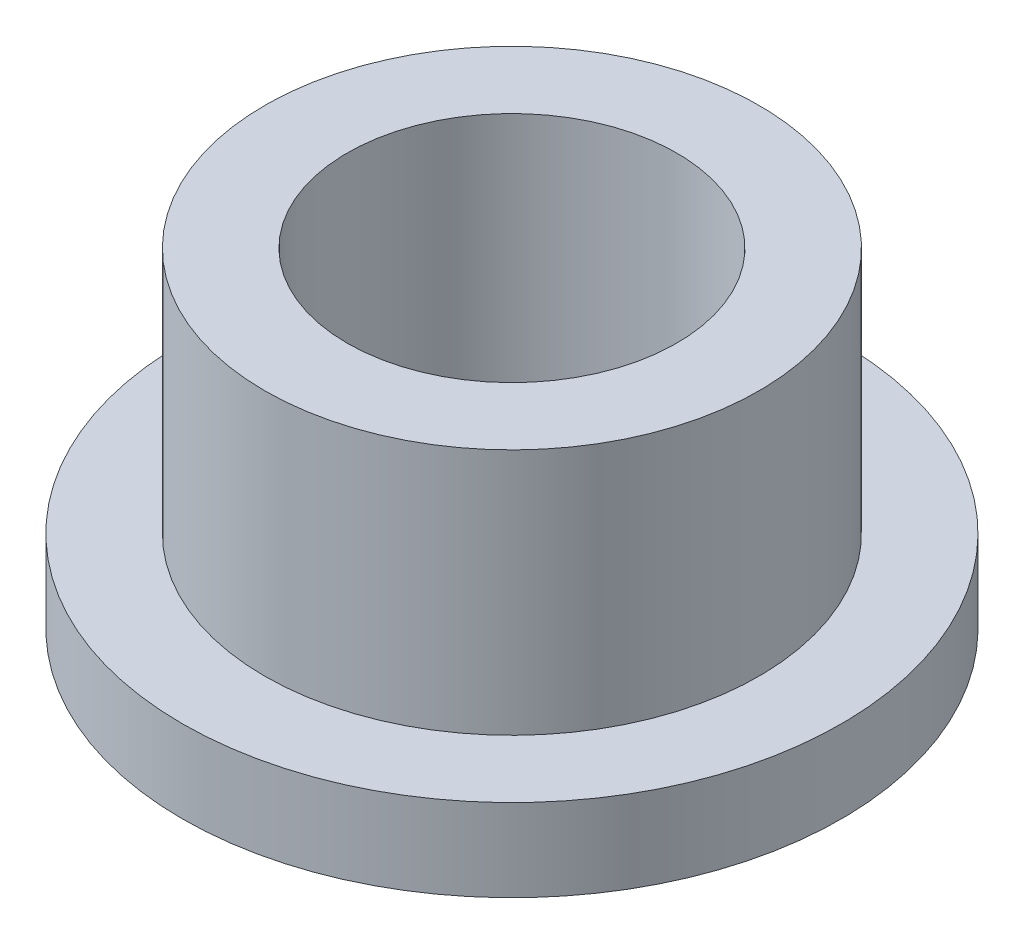
ISO-10303-21;
HEADER;
FILE_DESCRIPTION(('STEP AP214'),'2;1');
FILE_NAME('part.step','',(''),(''),'','','');
FILE_SCHEMA(('AUTOMOTIVE_DESIGN { 1 0 10303 214 1 1 1 1 }'));
ENDSEC;
DATA;
#1=APPLICATION_CONTEXT('core data for automotive mechanical design processes');
#2=APPLICATION_PROTOCOL_DEFINITION('international standard','automotive_design',2000,#1);
#3=PRODUCT_CONTEXT('',#1,'mechanical');
#4=PRODUCT('Part','Part','',(#3));
#5=PRODUCT_RELATED_PRODUCT_CATEGORY('part','',(#4));
#6=PRODUCT_DEFINITION_FORMATION('','',#4);
#7=PRODUCT_DEFINITION_CONTEXT('part definition',#1,'design');
#8=PRODUCT_DEFINITION('design','',#6,#7);
#9=PRODUCT_DEFINITION_SHAPE('','',#8);
#10=(LENGTH_UNIT() NAMED_UNIT(*) SI_UNIT(.MILLI.,.METRE.));
#11=(NAMED_UNIT(*) PLANE_ANGLE_UNIT() SI_UNIT($,.RADIAN.));
#12=(NAMED_UNIT(*) SI_UNIT($,.STERADIAN.) SOLID_ANGLE_UNIT());
#13=UNCERTAINTY_MEASURE_WITH_UNIT(LENGTH_MEASURE(1.E-05),#10,'distance_accuracy_value','');
#14=(GEOMETRIC_REPRESENTATION_CONTEXT(3) GLOBAL_UNCERTAINTY_ASSIGNED_CONTEXT((#13)) GLOBAL_UNIT_ASSIGNED_CONTEXT((#10,
#11,#12)) REPRESENTATION_CONTEXT('',''));
#15=CARTESIAN_POINT('',(0.,0.,0.));
#16=DIRECTION('',(0.,0.,1.));
#17=DIRECTION('',(1.,0.,0.));
#18=AXIS2_PLACEMENT_3D('',#15,#16,#17);
#19=CARTESIAN_POINT('',(0.,9.525,0.));
#20=DIRECTION('',(0.,-1.,0.));
#21=DIRECTION('',(0.,0.,-1.));
#22=AXIS2_PLACEMENT_3D('',#19,#20,#21);
#23=CYLINDRICAL_SURFACE('',#22,4.7625);
#24=CARTESIAN_POINT('',(0.,1.5875,0.));
#25=DIRECTION('',(0.,1.,0.));
#26=DIRECTION('',(0.,0.,1.));
#27=AXIS2_PLACEMENT_3D('',#24,#25,#26);
#28=CIRCLE('',#27,4.7625);
#29=CARTESIAN_POINT('',(0.,1.5875,4.7625));
#30=VERTEX_POINT('',#29);
#31=EDGE_CURVE('E61',#30,#30,#28,.T.);
#32=ORIENTED_EDGE('',*,*,#31,.T.);
#33=EDGE_LOOP('',(#32));
#34=FACE_BOUND('',#33,.T.);
#35=CARTESIAN_POINT('',(0.,6.35,0.));
#36=DIRECTION('',(0.,1.,0.));
#37=DIRECTION('',(0.,0.,1.));
#38=AXIS2_PLACEMENT_3D('',#35,#36,#37);
#39=CIRCLE('',#38,4.7625);
#40=CARTESIAN_POINT('',(0.,6.35,4.7625));
#41=VERTEX_POINT('',#40);
#42=EDGE_CURVE('E66',#41,#41,#39,.T.);
#43=ORIENTED_EDGE('',*,*,#42,.F.);
#44=EDGE_LOOP('',(#43));
#45=FACE_BOUND('',#44,.T.);
#46=ADVANCED_FACE('F41',(#34,#45),#23,.T.);
#47=CARTESIAN_POINT('',(0.,9.525,0.));
#48=DIRECTION('',(0.,-1.,0.));
#49=DIRECTION('',(0.,0.,-1.));
#50=AXIS2_PLACEMENT_3D('',#47,#48,#49);
#51=CYLINDRICAL_SURFACE('',#50,3.175);
#52=CARTESIAN_POINT('',(0.,0.,0.));
#53=DIRECTION('',(0.,1.,0.));
#54=DIRECTION('',(0.,0.,1.));
#55=AXIS2_PLACEMENT_3D('',#52,#53,#54);
#56=CIRCLE('',#55,3.175);
#57=CARTESIAN_POINT('',(0.,0.,3.175));
#58=VERTEX_POINT('',#57);
#59=EDGE_CURVE('E12',#58,#58,#56,.T.);
#60=ORIENTED_EDGE('',*,*,#59,.F.);
#61=EDGE_LOOP('',(#60));
#62=FACE_BOUND('',#61,.T.);
#63=CARTESIAN_POINT('',(0.,6.35,0.));
#64=DIRECTION('',(0.,1.,0.));
#65=DIRECTION('',(0.,0.,1.));
#66=AXIS2_PLACEMENT_3D('',#63,#64,#65);
#67=CIRCLE('',#66,3.175);
#68=CARTESIAN_POINT('',(0.,6.35,3.175));
#69=VERTEX_POINT('',#68);
#70=EDGE_CURVE('E44',#69,#69,#67,.T.);
#71=ORIENTED_EDGE('',*,*,#70,.T.);
#72=EDGE_LOOP('',(#71));
#73=FACE_BOUND('',#72,.T.);
#74=ADVANCED_FACE('F73',(#62,#73),#51,.F.);
#75=CARTESIAN_POINT('',(0.,0.,0.));
#76=DIRECTION('',(0.,1.,0.));
#77=DIRECTION('',(0.,0.,1.));
#78=AXIS2_PLACEMENT_3D('',#75,#76,#77);
#79=PLANE('',#78);
#80=ORIENTED_EDGE('',*,*,#59,.T.);
#81=EDGE_LOOP('',(#80));
#82=FACE_BOUND('',#81,.T.);
#83=CARTESIAN_POINT('',(0.,0.,0.));
#84=DIRECTION('',(0.,1.,0.));
#85=DIRECTION('',(0.,0.,1.));
#86=AXIS2_PLACEMENT_3D('',#83,#84,#85);
#87=CIRCLE('',#86,6.35);
#88=CARTESIAN_POINT('',(0.,0.,6.35));
#89=VERTEX_POINT('',#88);
#90=EDGE_CURVE('E56',#89,#89,#87,.T.);
#91=ORIENTED_EDGE('',*,*,#90,.F.);
#92=EDGE_LOOP('',(#91));
#93=FACE_BOUND('',#92,.T.);
#94=ADVANCED_FACE('F91',(#82,#93),#79,.F.);
#95=CARTESIAN_POINT('',(0.,1.5875,0.));
#96=DIRECTION('',(0.,1.,0.));
#97=DIRECTION('',(0.,0.,1.));
#98=AXIS2_PLACEMENT_3D('',#95,#96,#97);
#99=PLANE('',#98);
#100=CARTESIAN_POINT('',(0.,1.5875,0.));
#101=DIRECTION('',(0.,1.,0.));
#102=DIRECTION('',(0.,0.,1.));
#103=AXIS2_PLACEMENT_3D('',#100,#101,#102);
#104=CIRCLE('',#103,6.35);
#105=CARTESIAN_POINT('',(0.,1.5875,6.35));
#106=VERTEX_POINT('',#105);
#107=EDGE_CURVE('E49',#106,#106,#104,.T.);
#108=ORIENTED_EDGE('',*,*,#107,.T.);
#109=EDGE_LOOP('',(#108));
#110=FACE_BOUND('',#109,.T.);
#111=ORIENTED_EDGE('',*,*,#31,.F.);
#112=EDGE_LOOP('',(#111));
#113=FACE_BOUND('',#112,.T.);
#114=ADVANCED_FACE('F82',(#110,#113),#99,.T.);
#115=CARTESIAN_POINT('',(0.,1.5875,0.));
#116=DIRECTION('',(0.,-1.,0.));
#117=DIRECTION('',(0.,0.,-1.));
#118=AXIS2_PLACEMENT_3D('',#115,#116,#117);
#119=CYLINDRICAL_SURFACE('',#118,6.35);
#120=ORIENTED_EDGE('',*,*,#107,.F.);
#121=EDGE_LOOP('',(#120));
#122=FACE_BOUND('',#121,.T.);
#123=ORIENTED_EDGE('',*,*,#90,.T.);
#124=EDGE_LOOP('',(#123));
#125=FACE_BOUND('',#124,.T.);
#126=ADVANCED_FACE('F77',(#122,#125),#119,.T.);
#127=CARTESIAN_POINT('',(0.,6.35,0.));
#128=DIRECTION('',(0.,1.,0.));
#129=DIRECTION('',(0.,0.,1.));
#130=AXIS2_PLACEMENT_3D('',#127,#128,#129);
#131=PLANE('',#130);
#132=ORIENTED_EDGE('',*,*,#70,.F.);
#133=EDGE_LOOP('',(#132));
#134=FACE_BOUND('',#133,.T.);
#135=ORIENTED_EDGE('',*,*,#42,.T.);
#136=EDGE_LOOP('',(#135));
#137=FACE_BOUND('',#136,.T.);
#138=ADVANCED_FACE('F75',(#134,#137),#131,.T.);
#139=CLOSED_SHELL('',(#46,#74,#94,#114,#126,#138));
#140=MANIFOLD_SOLID_BREP('B2',#139);
#141=ADVANCED_BREP_SHAPE_REPRESENTATION('',(#18,#140),#14);
#142=SHAPE_DEFINITION_REPRESENTATION(#9,#141);
ENDSEC;
END-ISO-10303-21;
